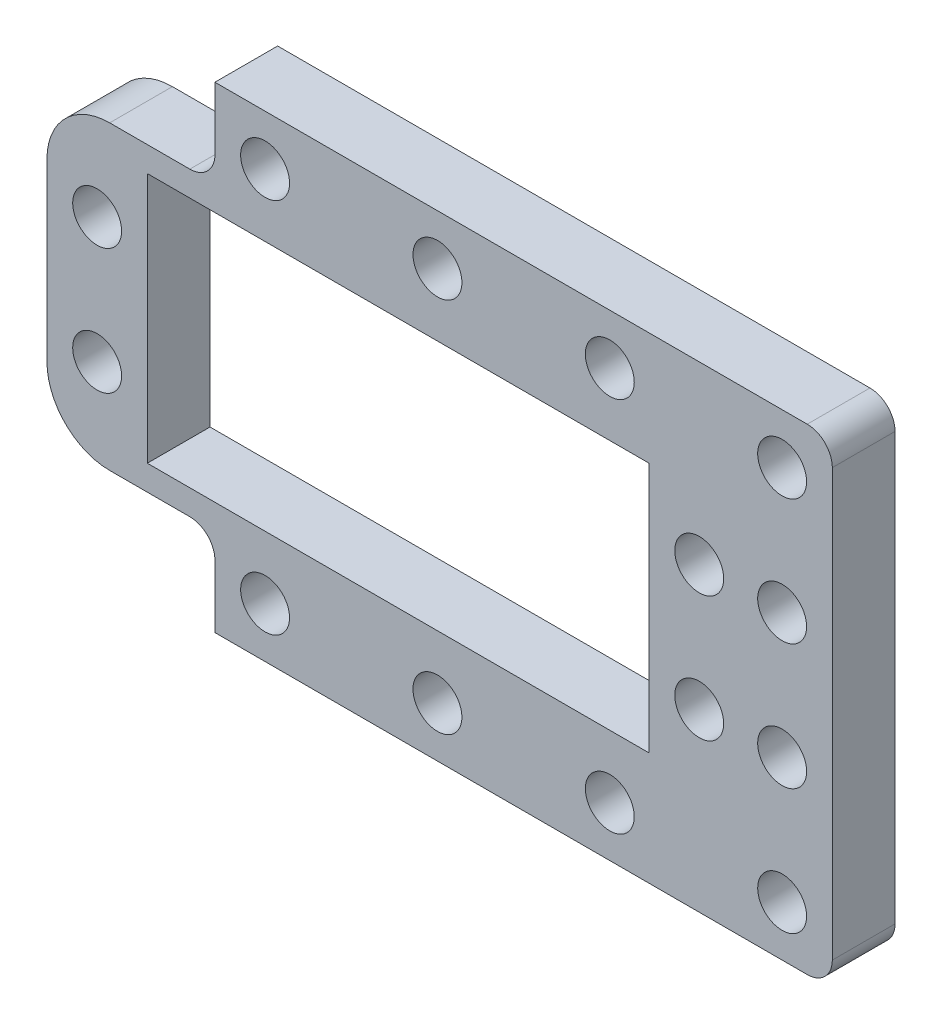
ISO-10303-21;
HEADER;
FILE_DESCRIPTION(('STEP AP214'),'2;1');
FILE_NAME('part.step','',(''),(''),'','','');
FILE_SCHEMA(('AUTOMOTIVE_DESIGN { 1 0 10303 214 1 1 1 1 }'));
ENDSEC;
DATA;
#1=APPLICATION_CONTEXT('core data for automotive mechanical design processes');
#2=APPLICATION_PROTOCOL_DEFINITION('international standard','automotive_design',2000,#1);
#3=PRODUCT_CONTEXT('',#1,'mechanical');
#4=PRODUCT('Part','Part','',(#3));
#5=PRODUCT_RELATED_PRODUCT_CATEGORY('part','',(#4));
#6=PRODUCT_DEFINITION_FORMATION('','',#4);
#7=PRODUCT_DEFINITION_CONTEXT('part definition',#1,'design');
#8=PRODUCT_DEFINITION('design','',#6,#7);
#9=PRODUCT_DEFINITION_SHAPE('','',#8);
#10=(LENGTH_UNIT() NAMED_UNIT(*) SI_UNIT(.MILLI.,.METRE.));
#11=(NAMED_UNIT(*) PLANE_ANGLE_UNIT() SI_UNIT($,.RADIAN.));
#12=(NAMED_UNIT(*) SI_UNIT($,.STERADIAN.) SOLID_ANGLE_UNIT());
#13=UNCERTAINTY_MEASURE_WITH_UNIT(LENGTH_MEASURE(1.E-05),#10,'distance_accuracy_value','');
#14=(GEOMETRIC_REPRESENTATION_CONTEXT(3) GLOBAL_UNCERTAINTY_ASSIGNED_CONTEXT((#13)) GLOBAL_UNIT_ASSIGNED_CONTEXT((#10,
#11,#12)) REPRESENTATION_CONTEXT('',''));
#15=CARTESIAN_POINT('',(0.,0.,0.));
#16=DIRECTION('',(0.,0.,1.));
#17=DIRECTION('',(1.,0.,0.));
#18=AXIS2_PLACEMENT_3D('',#15,#16,#17);
#19=CARTESIAN_POINT('',(-2.,-36.,5.));
#20=DIRECTION('',(0.,0.,1.));
#21=DIRECTION('',(1.,0.,0.));
#22=AXIS2_PLACEMENT_3D('',#19,#20,#21);
#23=PLANE('',#22);
#24=DIRECTION('',(0.,-1.,0.));
#25=VECTOR('',#24,1.);
#26=CARTESIAN_POINT('',(-62.61,-2.00000000000001,5.));
#27=LINE('',#26,#25);
#28=CARTESIAN_POINT('',(-62.61,-12.,5.));
#29=VERTEX_POINT('',#28);
#30=CARTESIAN_POINT('',(-62.61,-26.,5.));
#31=VERTEX_POINT('',#30);
#32=EDGE_CURVE('E253',#29,#31,#27,.T.);
#33=ORIENTED_EDGE('',*,*,#32,.T.);
#34=CARTESIAN_POINT('',(-57.61,-26.,5.));
#35=DIRECTION('',(0.,0.,1.));
#36=DIRECTION('',(1.,0.,0.));
#37=AXIS2_PLACEMENT_3D('',#34,#35,#36);
#38=CIRCLE('',#37,5.);
#39=CARTESIAN_POINT('',(-57.61,-31.,5.));
#40=VERTEX_POINT('',#39);
#41=EDGE_CURVE('E236',#31,#40,#38,.T.);
#42=ORIENTED_EDGE('',*,*,#41,.T.);
#43=DIRECTION('',(-1.,0.,0.));
#44=VECTOR('',#43,1.);
#45=CARTESIAN_POINT('',(-49.22,-31.,5.));
#46=LINE('',#45,#44);
#47=CARTESIAN_POINT('',(-51.22,-31.,5.));
#48=VERTEX_POINT('',#47);
#49=EDGE_CURVE('E252',#48,#40,#46,.T.);
#50=ORIENTED_EDGE('',*,*,#49,.F.);
#51=CARTESIAN_POINT('',(-51.22,-33.,5.));
#52=DIRECTION('',(0.,0.,1.));
#53=DIRECTION('',(1.,0.,0.));
#54=AXIS2_PLACEMENT_3D('',#51,#52,#53);
#55=CIRCLE('',#54,2.);
#56=CARTESIAN_POINT('',(-49.22,-33.,5.));
#57=VERTEX_POINT('',#56);
#58=EDGE_CURVE('E221',#48,#57,#55,.F.);
#59=ORIENTED_EDGE('',*,*,#58,.T.);
#60=DIRECTION('',(0.,1.,0.));
#61=VECTOR('',#60,1.);
#62=CARTESIAN_POINT('',(-49.22,-31.,5.));
#63=LINE('',#62,#61);
#64=CARTESIAN_POINT('',(-49.22,-38.,5.));
#65=VERTEX_POINT('',#64);
#66=EDGE_CURVE('E257',#65,#57,#63,.T.);
#67=ORIENTED_EDGE('',*,*,#66,.F.);
#68=DIRECTION('',(1.,0.,0.));
#69=VECTOR('',#68,1.);
#70=CARTESIAN_POINT('',(-2.,-38.,5.));
#71=LINE('',#70,#69);
#72=CARTESIAN_POINT('',(-2.,-38.,5.));
#73=VERTEX_POINT('',#72);
#74=EDGE_CURVE('E203',#65,#73,#71,.T.);
#75=ORIENTED_EDGE('',*,*,#74,.T.);
#76=CARTESIAN_POINT('',(-2.,-36.,5.));
#77=DIRECTION('',(0.,0.,1.));
#78=DIRECTION('',(1.,0.,0.));
#79=AXIS2_PLACEMENT_3D('',#76,#77,#78);
#80=CIRCLE('',#79,2.);
#81=CARTESIAN_POINT('',(0.,-36.,5.));
#82=VERTEX_POINT('',#81);
#83=EDGE_CURVE('E199',#73,#82,#80,.T.);
#84=ORIENTED_EDGE('',*,*,#83,.T.);
#85=DIRECTION('',(0.,1.,0.));
#86=VECTOR('',#85,1.);
#87=CARTESIAN_POINT('',(0.,-2.,5.));
#88=LINE('',#87,#86);
#89=CARTESIAN_POINT('',(0.,-2.,5.));
#90=VERTEX_POINT('',#89);
#91=EDGE_CURVE('E384',#82,#90,#88,.T.);
#92=ORIENTED_EDGE('',*,*,#91,.T.);
#93=CARTESIAN_POINT('',(-2.,-2.,5.));
#94=DIRECTION('',(0.,0.,1.));
#95=DIRECTION('',(-1.,0.,0.));
#96=AXIS2_PLACEMENT_3D('',#93,#94,#95);
#97=CIRCLE('',#96,2.);
#98=CARTESIAN_POINT('',(-2.,0.,5.));
#99=VERTEX_POINT('',#98);
#100=EDGE_CURVE('E386',#90,#99,#97,.T.);
#101=ORIENTED_EDGE('',*,*,#100,.T.);
#102=DIRECTION('',(-1.,0.,0.));
#103=VECTOR('',#102,1.);
#104=CARTESIAN_POINT('',(-2.,0.,5.));
#105=LINE('',#104,#103);
#106=CARTESIAN_POINT('',(-49.22,0.,5.));
#107=VERTEX_POINT('',#106);
#108=EDGE_CURVE('E388',#99,#107,#105,.T.);
#109=ORIENTED_EDGE('',*,*,#108,.T.);
#110=DIRECTION('',(0.,1.,0.));
#111=VECTOR('',#110,1.);
#112=CARTESIAN_POINT('',(-49.22,0.,5.));
#113=LINE('',#112,#111);
#114=CARTESIAN_POINT('',(-49.22,-5.,5.));
#115=VERTEX_POINT('',#114);
#116=EDGE_CURVE('E178',#115,#107,#113,.T.);
#117=ORIENTED_EDGE('',*,*,#116,.F.);
#118=CARTESIAN_POINT('',(-51.22,-5.,5.));
#119=DIRECTION('',(0.,0.,1.));
#120=DIRECTION('',(1.,0.,0.));
#121=AXIS2_PLACEMENT_3D('',#118,#119,#120);
#122=CIRCLE('',#121,2.);
#123=CARTESIAN_POINT('',(-51.22,-7.,5.));
#124=VERTEX_POINT('',#123);
#125=EDGE_CURVE('E225',#115,#124,#122,.F.);
#126=ORIENTED_EDGE('',*,*,#125,.T.);
#127=DIRECTION('',(1.,0.,0.));
#128=VECTOR('',#127,1.);
#129=CARTESIAN_POINT('',(-49.22,-7.,5.));
#130=LINE('',#129,#128);
#131=CARTESIAN_POINT('',(-57.61,-7.,5.));
#132=VERTEX_POINT('',#131);
#133=EDGE_CURVE('E172',#132,#124,#130,.T.);
#134=ORIENTED_EDGE('',*,*,#133,.F.);
#135=CARTESIAN_POINT('',(-57.61,-12.,5.));
#136=DIRECTION('',(0.,0.,1.));
#137=DIRECTION('',(1.,0.,0.));
#138=AXIS2_PLACEMENT_3D('',#135,#136,#137);
#139=CIRCLE('',#138,5.);
#140=EDGE_CURVE('E234',#132,#29,#139,.T.);
#141=ORIENTED_EDGE('',*,*,#140,.T.);
#142=EDGE_LOOP('',(#33,#42,#50,#59,#67,#75,#84,#92,#101,#109,#117,#126,#134,#141));
#143=FACE_BOUND('',#142,.T.);
#144=CARTESIAN_POINT('',(-17.74,-34.,5.));
#145=DIRECTION('',(0.,0.,1.));
#146=DIRECTION('',(-1.,0.,0.));
#147=AXIS2_PLACEMENT_3D('',#144,#145,#146);
#148=CIRCLE('',#147,1.95);
#149=CARTESIAN_POINT('',(-19.69,-34.,5.));
#150=VERTEX_POINT('',#149);
#151=EDGE_CURVE('E273',#150,#150,#148,.T.);
#152=ORIENTED_EDGE('',*,*,#151,.F.);
#153=EDGE_LOOP('',(#152));
#154=FACE_BOUND('',#153,.T.);
#155=CARTESIAN_POINT('',(-3.99999999999999,-34.,5.));
#156=DIRECTION('',(0.,0.,1.));
#157=DIRECTION('',(-1.,0.,0.));
#158=AXIS2_PLACEMENT_3D('',#155,#156,#157);
#159=CIRCLE('',#158,1.95);
#160=CARTESIAN_POINT('',(-5.94999999999999,-34.,5.));
#161=VERTEX_POINT('',#160);
#162=EDGE_CURVE('E285',#161,#161,#159,.T.);
#163=ORIENTED_EDGE('',*,*,#162,.F.);
#164=EDGE_LOOP('',(#163));
#165=FACE_BOUND('',#164,.T.);
#166=CARTESIAN_POINT('',(-4.,-14.,5.));
#167=DIRECTION('',(0.,0.,1.));
#168=DIRECTION('',(1.,0.,0.));
#169=AXIS2_PLACEMENT_3D('',#166,#167,#168);
#170=CIRCLE('',#169,1.95);
#171=CARTESIAN_POINT('',(-2.05,-14.,5.));
#172=VERTEX_POINT('',#171);
#173=EDGE_CURVE('E297',#172,#172,#170,.T.);
#174=ORIENTED_EDGE('',*,*,#173,.F.);
#175=EDGE_LOOP('',(#174));
#176=FACE_BOUND('',#175,.T.);
#177=CARTESIAN_POINT('',(-45.22,-4.00000000000001,5.));
#178=DIRECTION('',(0.,0.,1.));
#179=DIRECTION('',(1.,0.,0.));
#180=AXIS2_PLACEMENT_3D('',#177,#178,#179);
#181=CIRCLE('',#180,1.95);
#182=CARTESIAN_POINT('',(-43.27,-4.00000000000001,5.));
#183=VERTEX_POINT('',#182);
#184=EDGE_CURVE('E309',#183,#183,#181,.T.);
#185=ORIENTED_EDGE('',*,*,#184,.F.);
#186=EDGE_LOOP('',(#185));
#187=FACE_BOUND('',#186,.T.);
#188=CARTESIAN_POINT('',(-58.61,-24.,5.));
#189=DIRECTION('',(0.,0.,1.));
#190=DIRECTION('',(-1.,0.,0.));
#191=AXIS2_PLACEMENT_3D('',#188,#189,#190);
#192=CIRCLE('',#191,1.95);
#193=CARTESIAN_POINT('',(-60.56,-24.,5.));
#194=VERTEX_POINT('',#193);
#195=EDGE_CURVE('E321',#194,#194,#192,.T.);
#196=ORIENTED_EDGE('',*,*,#195,.F.);
#197=EDGE_LOOP('',(#196));
#198=FACE_BOUND('',#197,.T.);
#199=CARTESIAN_POINT('',(-10.61,-24.,5.));
#200=DIRECTION('',(0.,0.,1.));
#201=DIRECTION('',(1.,0.,0.));
#202=AXIS2_PLACEMENT_3D('',#199,#200,#201);
#203=CIRCLE('',#202,1.95);
#204=CARTESIAN_POINT('',(-8.65999999999999,-24.,5.));
#205=VERTEX_POINT('',#204);
#206=EDGE_CURVE('E333',#205,#205,#203,.T.);
#207=ORIENTED_EDGE('',*,*,#206,.F.);
#208=EDGE_LOOP('',(#207));
#209=FACE_BOUND('',#208,.T.);
#210=DIRECTION('',(1.,0.,0.));
#211=VECTOR('',#210,1.);
#212=CARTESIAN_POINT('',(-54.61,-29.,5.));
#213=LINE('',#212,#211);
#214=CARTESIAN_POINT('',(-54.61,-29.,5.));
#215=VERTEX_POINT('',#214);
#216=CARTESIAN_POINT('',(-14.61,-29.,5.));
#217=VERTEX_POINT('',#216);
#218=EDGE_CURVE('E347',#215,#217,#213,.T.);
#219=ORIENTED_EDGE('',*,*,#218,.F.);
#220=DIRECTION('',(0.,-1.,0.));
#221=VECTOR('',#220,1.);
#222=CARTESIAN_POINT('',(-54.61,-9.,5.));
#223=LINE('',#222,#221);
#224=CARTESIAN_POINT('',(-54.61,-9.,5.));
#225=VERTEX_POINT('',#224);
#226=EDGE_CURVE('E345',#225,#215,#223,.T.);
#227=ORIENTED_EDGE('',*,*,#226,.F.);
#228=DIRECTION('',(-1.,0.,0.));
#229=VECTOR('',#228,1.);
#230=CARTESIAN_POINT('',(-54.61,-9.,5.));
#231=LINE('',#230,#229);
#232=CARTESIAN_POINT('',(-14.61,-9.,5.));
#233=VERTEX_POINT('',#232);
#234=EDGE_CURVE('E353',#233,#225,#231,.T.);
#235=ORIENTED_EDGE('',*,*,#234,.F.);
#236=DIRECTION('',(0.,1.,0.));
#237=VECTOR('',#236,1.);
#238=CARTESIAN_POINT('',(-14.61,-9.,5.));
#239=LINE('',#238,#237);
#240=EDGE_CURVE('E350',#217,#233,#239,.T.);
#241=ORIENTED_EDGE('',*,*,#240,.F.);
#242=EDGE_LOOP('',(#219,#227,#235,#241));
#243=FACE_BOUND('',#242,.T.);
#244=CARTESIAN_POINT('',(-4.,-24.,5.));
#245=DIRECTION('',(0.,0.,1.));
#246=DIRECTION('',(1.,0.,0.));
#247=AXIS2_PLACEMENT_3D('',#244,#245,#246);
#248=CIRCLE('',#247,1.95);
#249=CARTESIAN_POINT('',(-2.05,-24.,5.));
#250=VERTEX_POINT('',#249);
#251=EDGE_CURVE('E376',#250,#250,#248,.T.);
#252=ORIENTED_EDGE('',*,*,#251,.F.);
#253=EDGE_LOOP('',(#252));
#254=FACE_BOUND('',#253,.T.);
#255=CARTESIAN_POINT('',(-45.22,-34.,5.));
#256=DIRECTION('',(0.,0.,1.));
#257=DIRECTION('',(-1.,0.,0.));
#258=AXIS2_PLACEMENT_3D('',#255,#256,#257);
#259=CIRCLE('',#258,1.95);
#260=CARTESIAN_POINT('',(-47.17,-34.,5.));
#261=VERTEX_POINT('',#260);
#262=EDGE_CURVE('E339',#261,#261,#259,.T.);
#263=ORIENTED_EDGE('',*,*,#262,.F.);
#264=EDGE_LOOP('',(#263));
#265=FACE_BOUND('',#264,.T.);
#266=CARTESIAN_POINT('',(-10.61,-14.,5.));
#267=DIRECTION('',(0.,0.,1.));
#268=DIRECTION('',(1.,0.,0.));
#269=AXIS2_PLACEMENT_3D('',#266,#267,#268);
#270=CIRCLE('',#269,1.95);
#271=CARTESIAN_POINT('',(-8.65999999999999,-14.,5.));
#272=VERTEX_POINT('',#271);
#273=EDGE_CURVE('E327',#272,#272,#270,.T.);
#274=ORIENTED_EDGE('',*,*,#273,.F.);
#275=EDGE_LOOP('',(#274));
#276=FACE_BOUND('',#275,.T.);
#277=CARTESIAN_POINT('',(-58.61,-14.,5.));
#278=DIRECTION('',(0.,0.,1.));
#279=DIRECTION('',(-1.,0.,0.));
#280=AXIS2_PLACEMENT_3D('',#277,#278,#279);
#281=CIRCLE('',#280,1.95);
#282=CARTESIAN_POINT('',(-60.56,-14.,5.));
#283=VERTEX_POINT('',#282);
#284=EDGE_CURVE('E315',#283,#283,#281,.T.);
#285=ORIENTED_EDGE('',*,*,#284,.F.);
#286=EDGE_LOOP('',(#285));
#287=FACE_BOUND('',#286,.T.);
#288=CARTESIAN_POINT('',(-4.,-4.00000000000001,5.));
#289=DIRECTION('',(0.,0.,1.));
#290=DIRECTION('',(1.,0.,0.));
#291=AXIS2_PLACEMENT_3D('',#288,#289,#290);
#292=CIRCLE('',#291,1.95);
#293=CARTESIAN_POINT('',(-2.05,-4.00000000000001,5.));
#294=VERTEX_POINT('',#293);
#295=EDGE_CURVE('E303',#294,#294,#292,.T.);
#296=ORIENTED_EDGE('',*,*,#295,.F.);
#297=EDGE_LOOP('',(#296));
#298=FACE_BOUND('',#297,.T.);
#299=CARTESIAN_POINT('',(-31.48,-4.00000000000001,5.));
#300=DIRECTION('',(0.,0.,1.));
#301=DIRECTION('',(1.,0.,0.));
#302=AXIS2_PLACEMENT_3D('',#299,#300,#301);
#303=CIRCLE('',#302,1.95);
#304=CARTESIAN_POINT('',(-29.53,-4.00000000000001,5.));
#305=VERTEX_POINT('',#304);
#306=EDGE_CURVE('E291',#305,#305,#303,.T.);
#307=ORIENTED_EDGE('',*,*,#306,.F.);
#308=EDGE_LOOP('',(#307));
#309=FACE_BOUND('',#308,.T.);
#310=CARTESIAN_POINT('',(-17.74,-4.00000000000001,5.));
#311=DIRECTION('',(0.,0.,1.));
#312=DIRECTION('',(1.,0.,0.));
#313=AXIS2_PLACEMENT_3D('',#310,#311,#312);
#314=CIRCLE('',#313,1.95);
#315=CARTESIAN_POINT('',(-15.79,-4.00000000000001,5.));
#316=VERTEX_POINT('',#315);
#317=EDGE_CURVE('E279',#316,#316,#314,.T.);
#318=ORIENTED_EDGE('',*,*,#317,.F.);
#319=EDGE_LOOP('',(#318));
#320=FACE_BOUND('',#319,.T.);
#321=CARTESIAN_POINT('',(-31.48,-34.,5.));
#322=DIRECTION('',(0.,0.,1.));
#323=DIRECTION('',(-1.,0.,0.));
#324=AXIS2_PLACEMENT_3D('',#321,#322,#323);
#325=CIRCLE('',#324,1.95);
#326=CARTESIAN_POINT('',(-33.43,-34.,5.));
#327=VERTEX_POINT('',#326);
#328=EDGE_CURVE('E267',#327,#327,#325,.T.);
#329=ORIENTED_EDGE('',*,*,#328,.F.);
#330=EDGE_LOOP('',(#329));
#331=FACE_BOUND('',#330,.T.);
#332=ADVANCED_FACE('F32',(#143,#154,#165,#176,#187,#198,#209,#243,#254,#265,#276,#287,#298,#309,
#320,#331),#23,.T.);
#333=CARTESIAN_POINT('',(-2.,-36.,0.));
#334=DIRECTION('',(0.,0.,1.));
#335=DIRECTION('',(1.,0.,0.));
#336=AXIS2_PLACEMENT_3D('',#333,#334,#335);
#337=PLANE('',#336);
#338=CARTESIAN_POINT('',(-4.,-24.,0.));
#339=DIRECTION('',(0.,0.,1.));
#340=DIRECTION('',(1.,0.,0.));
#341=AXIS2_PLACEMENT_3D('',#338,#339,#340);
#342=CIRCLE('',#341,1.95);
#343=CARTESIAN_POINT('',(-2.05,-24.,0.));
#344=VERTEX_POINT('',#343);
#345=EDGE_CURVE('E375',#344,#344,#342,.T.);
#346=ORIENTED_EDGE('',*,*,#345,.T.);
#347=EDGE_LOOP('',(#346));
#348=FACE_BOUND('',#347,.T.);
#349=DIRECTION('',(-1.,0.,0.));
#350=VECTOR('',#349,1.);
#351=CARTESIAN_POINT('',(-49.22,-31.,0.));
#352=LINE('',#351,#350);
#353=CARTESIAN_POINT('',(-51.22,-31.,0.));
#354=VERTEX_POINT('',#353);
#355=CARTESIAN_POINT('',(-57.61,-31.,0.));
#356=VERTEX_POINT('',#355);
#357=EDGE_CURVE('E240',#354,#356,#352,.T.);
#358=ORIENTED_EDGE('',*,*,#357,.T.);
#359=CARTESIAN_POINT('',(-57.61,-26.,0.));
#360=DIRECTION('',(0.,0.,1.));
#361=DIRECTION('',(1.,0.,0.));
#362=AXIS2_PLACEMENT_3D('',#359,#360,#361);
#363=CIRCLE('',#362,5.);
#364=CARTESIAN_POINT('',(-62.61,-26.,0.));
#365=VERTEX_POINT('',#364);
#366=EDGE_CURVE('E40',#356,#365,#363,.F.);
#367=ORIENTED_EDGE('',*,*,#366,.T.);
#368=DIRECTION('',(0.,-1.,0.));
#369=VECTOR('',#368,1.);
#370=CARTESIAN_POINT('',(-62.61,-2.00000000000001,0.));
#371=LINE('',#370,#369);
#372=CARTESIAN_POINT('',(-62.61,-12.,0.));
#373=VERTEX_POINT('',#372);
#374=EDGE_CURVE('E188',#373,#365,#371,.T.);
#375=ORIENTED_EDGE('',*,*,#374,.F.);
#376=CARTESIAN_POINT('',(-57.61,-12.,0.));
#377=DIRECTION('',(0.,0.,1.));
#378=DIRECTION('',(1.,0.,0.));
#379=AXIS2_PLACEMENT_3D('',#376,#377,#378);
#380=CIRCLE('',#379,5.);
#381=CARTESIAN_POINT('',(-57.61,-7.,0.));
#382=VERTEX_POINT('',#381);
#383=EDGE_CURVE('E47',#373,#382,#380,.F.);
#384=ORIENTED_EDGE('',*,*,#383,.T.);
#385=DIRECTION('',(1.,0.,0.));
#386=VECTOR('',#385,1.);
#387=CARTESIAN_POINT('',(-49.22,-7.,0.));
#388=LINE('',#387,#386);
#389=CARTESIAN_POINT('',(-51.22,-7.,0.));
#390=VERTEX_POINT('',#389);
#391=EDGE_CURVE('E171',#382,#390,#388,.T.);
#392=ORIENTED_EDGE('',*,*,#391,.T.);
#393=CARTESIAN_POINT('',(-51.22,-5.,0.));
#394=DIRECTION('',(0.,0.,1.));
#395=DIRECTION('',(1.,0.,0.));
#396=AXIS2_PLACEMENT_3D('',#393,#394,#395);
#397=CIRCLE('',#396,2.);
#398=CARTESIAN_POINT('',(-49.22,-5.,0.));
#399=VERTEX_POINT('',#398);
#400=EDGE_CURVE('E167',#390,#399,#397,.T.);
#401=ORIENTED_EDGE('',*,*,#400,.T.);
#402=DIRECTION('',(0.,1.,0.));
#403=VECTOR('',#402,1.);
#404=CARTESIAN_POINT('',(-49.22,0.,0.));
#405=LINE('',#404,#403);
#406=CARTESIAN_POINT('',(-49.22,0.,0.));
#407=VERTEX_POINT('',#406);
#408=EDGE_CURVE('E159',#399,#407,#405,.T.);
#409=ORIENTED_EDGE('',*,*,#408,.T.);
#410=DIRECTION('',(-1.,0.,0.));
#411=VECTOR('',#410,1.);
#412=CARTESIAN_POINT('',(-2.,0.,0.));
#413=LINE('',#412,#411);
#414=CARTESIAN_POINT('',(-2.,0.,0.));
#415=VERTEX_POINT('',#414);
#416=EDGE_CURVE('E165',#415,#407,#413,.T.);
#417=ORIENTED_EDGE('',*,*,#416,.F.);
#418=CARTESIAN_POINT('',(-2.,-2.,0.));
#419=DIRECTION('',(0.,0.,1.));
#420=DIRECTION('',(-1.,0.,0.));
#421=AXIS2_PLACEMENT_3D('',#418,#419,#420);
#422=CIRCLE('',#421,2.);
#423=CARTESIAN_POINT('',(0.,-2.,0.));
#424=VERTEX_POINT('',#423);
#425=EDGE_CURVE('E189',#424,#415,#422,.T.);
#426=ORIENTED_EDGE('',*,*,#425,.F.);
#427=DIRECTION('',(0.,1.,0.));
#428=VECTOR('',#427,1.);
#429=CARTESIAN_POINT('',(0.,-2.,0.));
#430=LINE('',#429,#428);
#431=CARTESIAN_POINT('',(0.,-36.,0.));
#432=VERTEX_POINT('',#431);
#433=EDGE_CURVE('E194',#432,#424,#430,.T.);
#434=ORIENTED_EDGE('',*,*,#433,.F.);
#435=CARTESIAN_POINT('',(-2.,-36.,0.));
#436=DIRECTION('',(0.,0.,1.));
#437=DIRECTION('',(1.,0.,0.));
#438=AXIS2_PLACEMENT_3D('',#435,#436,#437);
#439=CIRCLE('',#438,2.);
#440=CARTESIAN_POINT('',(-2.,-38.,0.));
#441=VERTEX_POINT('',#440);
#442=EDGE_CURVE('E379',#441,#432,#439,.T.);
#443=ORIENTED_EDGE('',*,*,#442,.F.);
#444=DIRECTION('',(1.,0.,0.));
#445=VECTOR('',#444,1.);
#446=CARTESIAN_POINT('',(-2.,-38.,0.));
#447=LINE('',#446,#445);
#448=CARTESIAN_POINT('',(-49.22,-38.,0.));
#449=VERTEX_POINT('',#448);
#450=EDGE_CURVE('E192',#449,#441,#447,.T.);
#451=ORIENTED_EDGE('',*,*,#450,.F.);
#452=DIRECTION('',(0.,1.,0.));
#453=VECTOR('',#452,1.);
#454=CARTESIAN_POINT('',(-49.22,-31.,0.));
#455=LINE('',#454,#453);
#456=CARTESIAN_POINT('',(-49.22,-33.,0.));
#457=VERTEX_POINT('',#456);
#458=EDGE_CURVE('E256',#449,#457,#455,.T.);
#459=ORIENTED_EDGE('',*,*,#458,.T.);
#460=CARTESIAN_POINT('',(-51.22,-33.,0.));
#461=DIRECTION('',(0.,0.,1.));
#462=DIRECTION('',(1.,0.,0.));
#463=AXIS2_PLACEMENT_3D('',#460,#461,#462);
#464=CIRCLE('',#463,2.);
#465=EDGE_CURVE('E223',#457,#354,#464,.T.);
#466=ORIENTED_EDGE('',*,*,#465,.T.);
#467=EDGE_LOOP('',(#358,#367,#375,#384,#392,#401,#409,#417,#426,#434,#443,#451,#459,#466));
#468=FACE_BOUND('',#467,.T.);
#469=DIRECTION('',(0.,-1.,0.));
#470=VECTOR('',#469,1.);
#471=CARTESIAN_POINT('',(-54.61,-9.,0.));
#472=LINE('',#471,#470);
#473=CARTESIAN_POINT('',(-54.61,-9.,0.));
#474=VERTEX_POINT('',#473);
#475=CARTESIAN_POINT('',(-54.61,-29.,0.));
#476=VERTEX_POINT('',#475);
#477=EDGE_CURVE('E342',#474,#476,#472,.T.);
#478=ORIENTED_EDGE('',*,*,#477,.T.);
#479=DIRECTION('',(1.,0.,0.));
#480=VECTOR('',#479,1.);
#481=CARTESIAN_POINT('',(-54.61,-29.,0.));
#482=LINE('',#481,#480);
#483=CARTESIAN_POINT('',(-14.61,-29.,0.));
#484=VERTEX_POINT('',#483);
#485=EDGE_CURVE('E358',#476,#484,#482,.T.);
#486=ORIENTED_EDGE('',*,*,#485,.T.);
#487=DIRECTION('',(0.,1.,0.));
#488=VECTOR('',#487,1.);
#489=CARTESIAN_POINT('',(-14.61,-9.,0.));
#490=LINE('',#489,#488);
#491=CARTESIAN_POINT('',(-14.61,-9.,0.));
#492=VERTEX_POINT('',#491);
#493=EDGE_CURVE('E361',#484,#492,#490,.T.);
#494=ORIENTED_EDGE('',*,*,#493,.T.);
#495=DIRECTION('',(-1.,0.,0.));
#496=VECTOR('',#495,1.);
#497=CARTESIAN_POINT('',(-54.61,-9.,0.));
#498=LINE('',#497,#496);
#499=EDGE_CURVE('E348',#492,#474,#498,.T.);
#500=ORIENTED_EDGE('',*,*,#499,.T.);
#501=EDGE_LOOP('',(#478,#486,#494,#500));
#502=FACE_BOUND('',#501,.T.);
#503=CARTESIAN_POINT('',(-45.22,-34.,0.));
#504=DIRECTION('',(0.,0.,1.));
#505=DIRECTION('',(-1.,0.,0.));
#506=AXIS2_PLACEMENT_3D('',#503,#504,#505);
#507=CIRCLE('',#506,1.95);
#508=CARTESIAN_POINT('',(-47.17,-34.,0.));
#509=VERTEX_POINT('',#508);
#510=EDGE_CURVE('E336',#509,#509,#507,.T.);
#511=ORIENTED_EDGE('',*,*,#510,.T.);
#512=EDGE_LOOP('',(#511));
#513=FACE_BOUND('',#512,.T.);
#514=CARTESIAN_POINT('',(-10.61,-24.,0.));
#515=DIRECTION('',(0.,0.,1.));
#516=DIRECTION('',(1.,0.,0.));
#517=AXIS2_PLACEMENT_3D('',#514,#515,#516);
#518=CIRCLE('',#517,1.95);
#519=CARTESIAN_POINT('',(-8.65999999999999,-24.,0.));
#520=VERTEX_POINT('',#519);
#521=EDGE_CURVE('E330',#520,#520,#518,.T.);
#522=ORIENTED_EDGE('',*,*,#521,.T.);
#523=EDGE_LOOP('',(#522));
#524=FACE_BOUND('',#523,.T.);
#525=CARTESIAN_POINT('',(-10.61,-14.,0.));
#526=DIRECTION('',(0.,0.,1.));
#527=DIRECTION('',(1.,0.,0.));
#528=AXIS2_PLACEMENT_3D('',#525,#526,#527);
#529=CIRCLE('',#528,1.95);
#530=CARTESIAN_POINT('',(-8.65999999999999,-14.,0.));
#531=VERTEX_POINT('',#530);
#532=EDGE_CURVE('E324',#531,#531,#529,.T.);
#533=ORIENTED_EDGE('',*,*,#532,.T.);
#534=EDGE_LOOP('',(#533));
#535=FACE_BOUND('',#534,.T.);
#536=CARTESIAN_POINT('',(-58.61,-24.,0.));
#537=DIRECTION('',(0.,0.,1.));
#538=DIRECTION('',(-1.,0.,0.));
#539=AXIS2_PLACEMENT_3D('',#536,#537,#538);
#540=CIRCLE('',#539,1.95);
#541=CARTESIAN_POINT('',(-60.56,-24.,0.));
#542=VERTEX_POINT('',#541);
#543=EDGE_CURVE('E318',#542,#542,#540,.T.);
#544=ORIENTED_EDGE('',*,*,#543,.T.);
#545=EDGE_LOOP('',(#544));
#546=FACE_BOUND('',#545,.T.);
#547=CARTESIAN_POINT('',(-58.61,-14.,0.));
#548=DIRECTION('',(0.,0.,1.));
#549=DIRECTION('',(-1.,0.,0.));
#550=AXIS2_PLACEMENT_3D('',#547,#548,#549);
#551=CIRCLE('',#550,1.95);
#552=CARTESIAN_POINT('',(-60.56,-14.,0.));
#553=VERTEX_POINT('',#552);
#554=EDGE_CURVE('E312',#553,#553,#551,.T.);
#555=ORIENTED_EDGE('',*,*,#554,.T.);
#556=EDGE_LOOP('',(#555));
#557=FACE_BOUND('',#556,.T.);
#558=CARTESIAN_POINT('',(-45.22,-4.00000000000001,0.));
#559=DIRECTION('',(0.,0.,1.));
#560=DIRECTION('',(1.,0.,0.));
#561=AXIS2_PLACEMENT_3D('',#558,#559,#560);
#562=CIRCLE('',#561,1.95);
#563=CARTESIAN_POINT('',(-43.27,-4.00000000000001,0.));
#564=VERTEX_POINT('',#563);
#565=EDGE_CURVE('E306',#564,#564,#562,.T.);
#566=ORIENTED_EDGE('',*,*,#565,.T.);
#567=EDGE_LOOP('',(#566));
#568=FACE_BOUND('',#567,.T.);
#569=CARTESIAN_POINT('',(-4.,-4.00000000000001,0.));
#570=DIRECTION('',(0.,0.,1.));
#571=DIRECTION('',(1.,0.,0.));
#572=AXIS2_PLACEMENT_3D('',#569,#570,#571);
#573=CIRCLE('',#572,1.95);
#574=CARTESIAN_POINT('',(-2.05,-4.00000000000001,0.));
#575=VERTEX_POINT('',#574);
#576=EDGE_CURVE('E300',#575,#575,#573,.T.);
#577=ORIENTED_EDGE('',*,*,#576,.T.);
#578=EDGE_LOOP('',(#577));
#579=FACE_BOUND('',#578,.T.);
#580=CARTESIAN_POINT('',(-4.,-14.,0.));
#581=DIRECTION('',(0.,0.,1.));
#582=DIRECTION('',(1.,0.,0.));
#583=AXIS2_PLACEMENT_3D('',#580,#581,#582);
#584=CIRCLE('',#583,1.95);
#585=CARTESIAN_POINT('',(-2.05,-14.,0.));
#586=VERTEX_POINT('',#585);
#587=EDGE_CURVE('E294',#586,#586,#584,.T.);
#588=ORIENTED_EDGE('',*,*,#587,.T.);
#589=EDGE_LOOP('',(#588));
#590=FACE_BOUND('',#589,.T.);
#591=CARTESIAN_POINT('',(-31.48,-4.00000000000001,0.));
#592=DIRECTION('',(0.,0.,1.));
#593=DIRECTION('',(1.,0.,0.));
#594=AXIS2_PLACEMENT_3D('',#591,#592,#593);
#595=CIRCLE('',#594,1.95);
#596=CARTESIAN_POINT('',(-29.53,-4.00000000000001,0.));
#597=VERTEX_POINT('',#596);
#598=EDGE_CURVE('E288',#597,#597,#595,.T.);
#599=ORIENTED_EDGE('',*,*,#598,.T.);
#600=EDGE_LOOP('',(#599));
#601=FACE_BOUND('',#600,.T.);
#602=CARTESIAN_POINT('',(-3.99999999999999,-34.,0.));
#603=DIRECTION('',(0.,0.,1.));
#604=DIRECTION('',(-1.,0.,0.));
#605=AXIS2_PLACEMENT_3D('',#602,#603,#604);
#606=CIRCLE('',#605,1.95);
#607=CARTESIAN_POINT('',(-5.94999999999999,-34.,0.));
#608=VERTEX_POINT('',#607);
#609=EDGE_CURVE('E282',#608,#608,#606,.T.);
#610=ORIENTED_EDGE('',*,*,#609,.T.);
#611=EDGE_LOOP('',(#610));
#612=FACE_BOUND('',#611,.T.);
#613=CARTESIAN_POINT('',(-17.74,-4.00000000000001,0.));
#614=DIRECTION('',(0.,0.,1.));
#615=DIRECTION('',(1.,0.,0.));
#616=AXIS2_PLACEMENT_3D('',#613,#614,#615);
#617=CIRCLE('',#616,1.95);
#618=CARTESIAN_POINT('',(-15.79,-4.00000000000001,0.));
#619=VERTEX_POINT('',#618);
#620=EDGE_CURVE('E276',#619,#619,#617,.T.);
#621=ORIENTED_EDGE('',*,*,#620,.T.);
#622=EDGE_LOOP('',(#621));
#623=FACE_BOUND('',#622,.T.);
#624=CARTESIAN_POINT('',(-17.74,-34.,0.));
#625=DIRECTION('',(0.,0.,1.));
#626=DIRECTION('',(-1.,0.,0.));
#627=AXIS2_PLACEMENT_3D('',#624,#625,#626);
#628=CIRCLE('',#627,1.95);
#629=CARTESIAN_POINT('',(-19.69,-34.,0.));
#630=VERTEX_POINT('',#629);
#631=EDGE_CURVE('E270',#630,#630,#628,.T.);
#632=ORIENTED_EDGE('',*,*,#631,.T.);
#633=EDGE_LOOP('',(#632));
#634=FACE_BOUND('',#633,.T.);
#635=CARTESIAN_POINT('',(-31.48,-34.,0.));
#636=DIRECTION('',(0.,0.,1.));
#637=DIRECTION('',(-1.,0.,0.));
#638=AXIS2_PLACEMENT_3D('',#635,#636,#637);
#639=CIRCLE('',#638,1.95);
#640=CARTESIAN_POINT('',(-33.43,-34.,0.));
#641=VERTEX_POINT('',#640);
#642=EDGE_CURVE('E182',#641,#641,#639,.T.);
#643=ORIENTED_EDGE('',*,*,#642,.T.);
#644=EDGE_LOOP('',(#643));
#645=FACE_BOUND('',#644,.T.);
#646=ADVANCED_FACE('F161',(#348,#468,#502,#513,#524,#535,#546,#557,#568,#579,#590,#601,#612,
#623,#634,#645),#337,.F.);
#647=CARTESIAN_POINT('',(-2.,-36.,5.));
#648=DIRECTION('',(0.,0.,-1.));
#649=DIRECTION('',(-1.,0.,0.));
#650=AXIS2_PLACEMENT_3D('',#647,#648,#649);
#651=CYLINDRICAL_SURFACE('',#650,2.);
#652=ORIENTED_EDGE('',*,*,#442,.T.);
#653=DIRECTION('',(0.,0.,-1.));
#654=VECTOR('',#653,1.);
#655=CARTESIAN_POINT('',(0.,-36.,5.));
#656=LINE('',#655,#654);
#657=EDGE_CURVE('E208',#82,#432,#656,.T.);
#658=ORIENTED_EDGE('',*,*,#657,.F.);
#659=ORIENTED_EDGE('',*,*,#83,.F.);
#660=DIRECTION('',(0.,0.,-1.));
#661=VECTOR('',#660,1.);
#662=CARTESIAN_POINT('',(-2.,-38.,5.));
#663=LINE('',#662,#661);
#664=EDGE_CURVE('E200',#73,#441,#663,.T.);
#665=ORIENTED_EDGE('',*,*,#664,.T.);
#666=EDGE_LOOP('',(#652,#658,#659,#665));
#667=FACE_BOUND('',#666,.T.);
#668=ADVANCED_FACE('F406',(#667),#651,.T.);
#669=CARTESIAN_POINT('',(0.,-2.,5.));
#670=DIRECTION('',(-1.,0.,0.));
#671=DIRECTION('',(0.,-1.,0.));
#672=AXIS2_PLACEMENT_3D('',#669,#670,#671);
#673=PLANE('',#672);
#674=ORIENTED_EDGE('',*,*,#433,.T.);
#675=DIRECTION('',(0.,0.,-1.));
#676=VECTOR('',#675,1.);
#677=CARTESIAN_POINT('',(0.,-2.,5.));
#678=LINE('',#677,#676);
#679=EDGE_CURVE('E205',#90,#424,#678,.T.);
#680=ORIENTED_EDGE('',*,*,#679,.F.);
#681=ORIENTED_EDGE('',*,*,#91,.F.);
#682=ORIENTED_EDGE('',*,*,#657,.T.);
#683=EDGE_LOOP('',(#674,#680,#681,#682));
#684=FACE_BOUND('',#683,.T.);
#685=ADVANCED_FACE('F395',(#684),#673,.F.);
#686=CARTESIAN_POINT('',(-2.,-2.,5.));
#687=DIRECTION('',(0.,0.,-1.));
#688=DIRECTION('',(-1.,0.,0.));
#689=AXIS2_PLACEMENT_3D('',#686,#687,#688);
#690=CYLINDRICAL_SURFACE('',#689,2.);
#691=ORIENTED_EDGE('',*,*,#425,.T.);
#692=DIRECTION('',(0.,0.,-1.));
#693=VECTOR('',#692,1.);
#694=CARTESIAN_POINT('',(-2.,0.,5.));
#695=LINE('',#694,#693);
#696=EDGE_CURVE('E187',#99,#415,#695,.T.);
#697=ORIENTED_EDGE('',*,*,#696,.F.);
#698=ORIENTED_EDGE('',*,*,#100,.F.);
#699=ORIENTED_EDGE('',*,*,#679,.T.);
#700=EDGE_LOOP('',(#691,#697,#698,#699));
#701=FACE_BOUND('',#700,.T.);
#702=ADVANCED_FACE('F400',(#701),#690,.T.);
#703=CARTESIAN_POINT('',(-2.,0.,5.));
#704=DIRECTION('',(0.,-1.,0.));
#705=DIRECTION('',(1.,0.,0.));
#706=AXIS2_PLACEMENT_3D('',#703,#704,#705);
#707=PLANE('',#706);
#708=ORIENTED_EDGE('',*,*,#416,.T.);
#709=DIRECTION('',(0.,0.,1.));
#710=VECTOR('',#709,1.);
#711=CARTESIAN_POINT('',(-49.22,0.,0.));
#712=LINE('',#711,#710);
#713=EDGE_CURVE('E175',#407,#107,#712,.T.);
#714=ORIENTED_EDGE('',*,*,#713,.T.);
#715=ORIENTED_EDGE('',*,*,#108,.F.);
#716=ORIENTED_EDGE('',*,*,#696,.T.);
#717=EDGE_LOOP('',(#708,#714,#715,#716));
#718=FACE_BOUND('',#717,.T.);
#719=ADVANCED_FACE('F185',(#718),#707,.F.);
#720=CARTESIAN_POINT('',(-62.61,-2.00000000000001,5.));
#721=DIRECTION('',(1.,0.,0.));
#722=DIRECTION('',(0.,1.,0.));
#723=AXIS2_PLACEMENT_3D('',#720,#721,#722);
#724=PLANE('',#723);
#725=ORIENTED_EDGE('',*,*,#374,.T.);
#726=DIRECTION('',(0.,0.,1.));
#727=VECTOR('',#726,1.);
#728=CARTESIAN_POINT('',(-62.61,-26.,5.));
#729=LINE('',#728,#727);
#730=EDGE_CURVE('E231',#365,#31,#729,.T.);
#731=ORIENTED_EDGE('',*,*,#730,.T.);
#732=ORIENTED_EDGE('',*,*,#32,.F.);
#733=DIRECTION('',(0.,0.,1.));
#734=VECTOR('',#733,1.);
#735=CARTESIAN_POINT('',(-62.61,-12.,5.));
#736=LINE('',#735,#734);
#737=EDGE_CURVE('E229',#29,#373,#736,.F.);
#738=ORIENTED_EDGE('',*,*,#737,.T.);
#739=EDGE_LOOP('',(#725,#731,#732,#738));
#740=FACE_BOUND('',#739,.T.);
#741=ADVANCED_FACE('F244',(#740),#724,.F.);
#742=CARTESIAN_POINT('',(-2.,-38.,5.));
#743=DIRECTION('',(0.,1.,0.));
#744=DIRECTION('',(-1.,0.,0.));
#745=AXIS2_PLACEMENT_3D('',#742,#743,#744);
#746=PLANE('',#745);
#747=ORIENTED_EDGE('',*,*,#74,.F.);
#748=DIRECTION('',(0.,0.,1.));
#749=VECTOR('',#748,1.);
#750=CARTESIAN_POINT('',(-49.22,-38.,0.));
#751=LINE('',#750,#749);
#752=EDGE_CURVE('E265',#449,#65,#751,.T.);
#753=ORIENTED_EDGE('',*,*,#752,.F.);
#754=ORIENTED_EDGE('',*,*,#450,.T.);
#755=ORIENTED_EDGE('',*,*,#664,.F.);
#756=EDGE_LOOP('',(#747,#753,#754,#755));
#757=FACE_BOUND('',#756,.T.);
#758=ADVANCED_FACE('F411',(#757),#746,.F.);
#759=CARTESIAN_POINT('',(-4.,-24.,5.));
#760=DIRECTION('',(0.,0.,-1.));
#761=DIRECTION('',(-1.,0.,0.));
#762=AXIS2_PLACEMENT_3D('',#759,#760,#761);
#763=CYLINDRICAL_SURFACE('',#762,1.95);
#764=ORIENTED_EDGE('',*,*,#251,.T.);
#765=EDGE_LOOP('',(#764));
#766=FACE_BOUND('',#765,.T.);
#767=ORIENTED_EDGE('',*,*,#345,.F.);
#768=EDGE_LOOP('',(#767));
#769=FACE_BOUND('',#768,.T.);
#770=ADVANCED_FACE('F440',(#766,#769),#763,.F.);
#771=CARTESIAN_POINT('',(-54.61,-9.,5.));
#772=DIRECTION('',(1.,0.,0.));
#773=DIRECTION('',(0.,0.,-1.));
#774=AXIS2_PLACEMENT_3D('',#771,#772,#773);
#775=PLANE('',#774);
#776=ORIENTED_EDGE('',*,*,#477,.F.);
#777=DIRECTION('',(0.,0.,-1.));
#778=VECTOR('',#777,1.);
#779=CARTESIAN_POINT('',(-54.61,-9.,5.));
#780=LINE('',#779,#778);
#781=EDGE_CURVE('E355',#225,#474,#780,.T.);
#782=ORIENTED_EDGE('',*,*,#781,.F.);
#783=ORIENTED_EDGE('',*,*,#226,.T.);
#784=DIRECTION('',(0.,0.,-1.));
#785=VECTOR('',#784,1.);
#786=CARTESIAN_POINT('',(-54.61,-29.,5.));
#787=LINE('',#786,#785);
#788=EDGE_CURVE('E372',#215,#476,#787,.T.);
#789=ORIENTED_EDGE('',*,*,#788,.T.);
#790=EDGE_LOOP('',(#776,#782,#783,#789));
#791=FACE_BOUND('',#790,.T.);
#792=ADVANCED_FACE('F622',(#791),#775,.T.);
#793=CARTESIAN_POINT('',(-54.61,-29.,5.));
#794=DIRECTION('',(0.,1.,0.));
#795=DIRECTION('',(-1.,0.,0.));
#796=AXIS2_PLACEMENT_3D('',#793,#794,#795);
#797=PLANE('',#796);
#798=ORIENTED_EDGE('',*,*,#485,.F.);
#799=ORIENTED_EDGE('',*,*,#788,.F.);
#800=ORIENTED_EDGE('',*,*,#218,.T.);
#801=DIRECTION('',(0.,0.,-1.));
#802=VECTOR('',#801,1.);
#803=CARTESIAN_POINT('',(-14.61,-29.,5.));
#804=LINE('',#803,#802);
#805=EDGE_CURVE('E370',#217,#484,#804,.T.);
#806=ORIENTED_EDGE('',*,*,#805,.T.);
#807=EDGE_LOOP('',(#798,#799,#800,#806));
#808=FACE_BOUND('',#807,.T.);
#809=ADVANCED_FACE('F619',(#808),#797,.T.);
#810=CARTESIAN_POINT('',(-14.61,-9.,5.));
#811=DIRECTION('',(-1.,0.,0.));
#812=DIRECTION('',(0.,-1.,0.));
#813=AXIS2_PLACEMENT_3D('',#810,#811,#812);
#814=PLANE('',#813);
#815=ORIENTED_EDGE('',*,*,#493,.F.);
#816=ORIENTED_EDGE('',*,*,#805,.F.);
#817=ORIENTED_EDGE('',*,*,#240,.T.);
#818=DIRECTION('',(0.,0.,-1.));
#819=VECTOR('',#818,1.);
#820=CARTESIAN_POINT('',(-14.61,-9.,5.));
#821=LINE('',#820,#819);
#822=EDGE_CURVE('E368',#233,#492,#821,.T.);
#823=ORIENTED_EDGE('',*,*,#822,.T.);
#824=EDGE_LOOP('',(#815,#816,#817,#823));
#825=FACE_BOUND('',#824,.T.);
#826=ADVANCED_FACE('F615',(#825),#814,.T.);
#827=CARTESIAN_POINT('',(-54.61,-9.,5.));
#828=DIRECTION('',(0.,-1.,0.));
#829=DIRECTION('',(1.,0.,0.));
#830=AXIS2_PLACEMENT_3D('',#827,#828,#829);
#831=PLANE('',#830);
#832=ORIENTED_EDGE('',*,*,#499,.F.);
#833=ORIENTED_EDGE('',*,*,#822,.F.);
#834=ORIENTED_EDGE('',*,*,#234,.T.);
#835=ORIENTED_EDGE('',*,*,#781,.T.);
#836=EDGE_LOOP('',(#832,#833,#834,#835));
#837=FACE_BOUND('',#836,.T.);
#838=ADVANCED_FACE('F611',(#837),#831,.T.);
#839=CARTESIAN_POINT('',(-45.22,-34.,5.));
#840=DIRECTION('',(0.,0.,-1.));
#841=DIRECTION('',(-1.,0.,0.));
#842=AXIS2_PLACEMENT_3D('',#839,#840,#841);
#843=CYLINDRICAL_SURFACE('',#842,1.95);
#844=ORIENTED_EDGE('',*,*,#262,.T.);
#845=EDGE_LOOP('',(#844));
#846=FACE_BOUND('',#845,.T.);
#847=ORIENTED_EDGE('',*,*,#510,.F.);
#848=EDGE_LOOP('',(#847));
#849=FACE_BOUND('',#848,.T.);
#850=ADVANCED_FACE('F607',(#846,#849),#843,.F.);
#851=CARTESIAN_POINT('',(-10.61,-24.,5.));
#852=DIRECTION('',(0.,0.,-1.));
#853=DIRECTION('',(-1.,0.,0.));
#854=AXIS2_PLACEMENT_3D('',#851,#852,#853);
#855=CYLINDRICAL_SURFACE('',#854,1.95);
#856=ORIENTED_EDGE('',*,*,#206,.T.);
#857=EDGE_LOOP('',(#856));
#858=FACE_BOUND('',#857,.T.);
#859=ORIENTED_EDGE('',*,*,#521,.F.);
#860=EDGE_LOOP('',(#859));
#861=FACE_BOUND('',#860,.T.);
#862=ADVANCED_FACE('F603',(#858,#861),#855,.F.);
#863=CARTESIAN_POINT('',(-10.61,-14.,5.));
#864=DIRECTION('',(0.,0.,-1.));
#865=DIRECTION('',(-1.,0.,0.));
#866=AXIS2_PLACEMENT_3D('',#863,#864,#865);
#867=CYLINDRICAL_SURFACE('',#866,1.95);
#868=ORIENTED_EDGE('',*,*,#273,.T.);
#869=EDGE_LOOP('',(#868));
#870=FACE_BOUND('',#869,.T.);
#871=ORIENTED_EDGE('',*,*,#532,.F.);
#872=EDGE_LOOP('',(#871));
#873=FACE_BOUND('',#872,.T.);
#874=ADVANCED_FACE('F599',(#870,#873),#867,.F.);
#875=CARTESIAN_POINT('',(-58.61,-24.,5.));
#876=DIRECTION('',(0.,0.,-1.));
#877=DIRECTION('',(-1.,0.,0.));
#878=AXIS2_PLACEMENT_3D('',#875,#876,#877);
#879=CYLINDRICAL_SURFACE('',#878,1.95);
#880=ORIENTED_EDGE('',*,*,#195,.T.);
#881=EDGE_LOOP('',(#880));
#882=FACE_BOUND('',#881,.T.);
#883=ORIENTED_EDGE('',*,*,#543,.F.);
#884=EDGE_LOOP('',(#883));
#885=FACE_BOUND('',#884,.T.);
#886=ADVANCED_FACE('F595',(#882,#885),#879,.F.);
#887=CARTESIAN_POINT('',(-58.61,-14.,5.));
#888=DIRECTION('',(0.,0.,-1.));
#889=DIRECTION('',(-1.,0.,0.));
#890=AXIS2_PLACEMENT_3D('',#887,#888,#889);
#891=CYLINDRICAL_SURFACE('',#890,1.95);
#892=ORIENTED_EDGE('',*,*,#284,.T.);
#893=EDGE_LOOP('',(#892));
#894=FACE_BOUND('',#893,.T.);
#895=ORIENTED_EDGE('',*,*,#554,.F.);
#896=EDGE_LOOP('',(#895));
#897=FACE_BOUND('',#896,.T.);
#898=ADVANCED_FACE('F591',(#894,#897),#891,.F.);
#899=CARTESIAN_POINT('',(-45.22,-4.00000000000001,5.));
#900=DIRECTION('',(0.,0.,-1.));
#901=DIRECTION('',(-1.,0.,0.));
#902=AXIS2_PLACEMENT_3D('',#899,#900,#901);
#903=CYLINDRICAL_SURFACE('',#902,1.95);
#904=ORIENTED_EDGE('',*,*,#184,.T.);
#905=EDGE_LOOP('',(#904));
#906=FACE_BOUND('',#905,.T.);
#907=ORIENTED_EDGE('',*,*,#565,.F.);
#908=EDGE_LOOP('',(#907));
#909=FACE_BOUND('',#908,.T.);
#910=ADVANCED_FACE('F587',(#906,#909),#903,.F.);
#911=CARTESIAN_POINT('',(-4.,-4.00000000000001,5.));
#912=DIRECTION('',(0.,0.,-1.));
#913=DIRECTION('',(-1.,0.,0.));
#914=AXIS2_PLACEMENT_3D('',#911,#912,#913);
#915=CYLINDRICAL_SURFACE('',#914,1.95);
#916=ORIENTED_EDGE('',*,*,#295,.T.);
#917=EDGE_LOOP('',(#916));
#918=FACE_BOUND('',#917,.T.);
#919=ORIENTED_EDGE('',*,*,#576,.F.);
#920=EDGE_LOOP('',(#919));
#921=FACE_BOUND('',#920,.T.);
#922=ADVANCED_FACE('F583',(#918,#921),#915,.F.);
#923=CARTESIAN_POINT('',(-4.,-14.,5.));
#924=DIRECTION('',(0.,0.,-1.));
#925=DIRECTION('',(-1.,0.,0.));
#926=AXIS2_PLACEMENT_3D('',#923,#924,#925);
#927=CYLINDRICAL_SURFACE('',#926,1.95);
#928=ORIENTED_EDGE('',*,*,#173,.T.);
#929=EDGE_LOOP('',(#928));
#930=FACE_BOUND('',#929,.T.);
#931=ORIENTED_EDGE('',*,*,#587,.F.);
#932=EDGE_LOOP('',(#931));
#933=FACE_BOUND('',#932,.T.);
#934=ADVANCED_FACE('F579',(#930,#933),#927,.F.);
#935=CARTESIAN_POINT('',(-31.48,-4.00000000000001,5.));
#936=DIRECTION('',(0.,0.,-1.));
#937=DIRECTION('',(-1.,0.,0.));
#938=AXIS2_PLACEMENT_3D('',#935,#936,#937);
#939=CYLINDRICAL_SURFACE('',#938,1.95);
#940=ORIENTED_EDGE('',*,*,#306,.T.);
#941=EDGE_LOOP('',(#940));
#942=FACE_BOUND('',#941,.T.);
#943=ORIENTED_EDGE('',*,*,#598,.F.);
#944=EDGE_LOOP('',(#943));
#945=FACE_BOUND('',#944,.T.);
#946=ADVANCED_FACE('F575',(#942,#945),#939,.F.);
#947=CARTESIAN_POINT('',(-3.99999999999999,-34.,5.));
#948=DIRECTION('',(0.,0.,-1.));
#949=DIRECTION('',(-1.,0.,0.));
#950=AXIS2_PLACEMENT_3D('',#947,#948,#949);
#951=CYLINDRICAL_SURFACE('',#950,1.95);
#952=ORIENTED_EDGE('',*,*,#162,.T.);
#953=EDGE_LOOP('',(#952));
#954=FACE_BOUND('',#953,.T.);
#955=ORIENTED_EDGE('',*,*,#609,.F.);
#956=EDGE_LOOP('',(#955));
#957=FACE_BOUND('',#956,.T.);
#958=ADVANCED_FACE('F571',(#954,#957),#951,.F.);
#959=CARTESIAN_POINT('',(-17.74,-4.00000000000001,5.));
#960=DIRECTION('',(0.,0.,-1.));
#961=DIRECTION('',(-1.,0.,0.));
#962=AXIS2_PLACEMENT_3D('',#959,#960,#961);
#963=CYLINDRICAL_SURFACE('',#962,1.95);
#964=ORIENTED_EDGE('',*,*,#317,.T.);
#965=EDGE_LOOP('',(#964));
#966=FACE_BOUND('',#965,.T.);
#967=ORIENTED_EDGE('',*,*,#620,.F.);
#968=EDGE_LOOP('',(#967));
#969=FACE_BOUND('',#968,.T.);
#970=ADVANCED_FACE('F567',(#966,#969),#963,.F.);
#971=CARTESIAN_POINT('',(-17.74,-34.,5.));
#972=DIRECTION('',(0.,0.,-1.));
#973=DIRECTION('',(-1.,0.,0.));
#974=AXIS2_PLACEMENT_3D('',#971,#972,#973);
#975=CYLINDRICAL_SURFACE('',#974,1.95);
#976=ORIENTED_EDGE('',*,*,#151,.T.);
#977=EDGE_LOOP('',(#976));
#978=FACE_BOUND('',#977,.T.);
#979=ORIENTED_EDGE('',*,*,#631,.F.);
#980=EDGE_LOOP('',(#979));
#981=FACE_BOUND('',#980,.T.);
#982=ADVANCED_FACE('F563',(#978,#981),#975,.F.);
#983=CARTESIAN_POINT('',(-31.48,-34.,5.));
#984=DIRECTION('',(0.,0.,-1.));
#985=DIRECTION('',(-1.,0.,0.));
#986=AXIS2_PLACEMENT_3D('',#983,#984,#985);
#987=CYLINDRICAL_SURFACE('',#986,1.95);
#988=ORIENTED_EDGE('',*,*,#328,.T.);
#989=EDGE_LOOP('',(#988));
#990=FACE_BOUND('',#989,.T.);
#991=ORIENTED_EDGE('',*,*,#642,.F.);
#992=EDGE_LOOP('',(#991));
#993=FACE_BOUND('',#992,.T.);
#994=ADVANCED_FACE('F533',(#990,#993),#987,.F.);
#995=CARTESIAN_POINT('',(-49.22,-31.,0.));
#996=DIRECTION('',(1.,0.,0.));
#997=DIRECTION('',(0.,0.,-1.));
#998=AXIS2_PLACEMENT_3D('',#995,#996,#997);
#999=PLANE('',#998);
#1000=ORIENTED_EDGE('',*,*,#66,.T.);
#1001=DIRECTION('',(0.,0.,1.));
#1002=VECTOR('',#1001,1.);
#1003=CARTESIAN_POINT('',(-49.22,-33.,0.));
#1004=LINE('',#1003,#1002);
#1005=EDGE_CURVE('E214',#57,#457,#1004,.F.);
#1006=ORIENTED_EDGE('',*,*,#1005,.T.);
#1007=ORIENTED_EDGE('',*,*,#458,.F.);
#1008=ORIENTED_EDGE('',*,*,#752,.T.);
#1009=EDGE_LOOP('',(#1000,#1006,#1007,#1008));
#1010=FACE_BOUND('',#1009,.T.);
#1011=ADVANCED_FACE('F413',(#1010),#999,.F.);
#1012=CARTESIAN_POINT('',(-49.22,-31.,0.));
#1013=DIRECTION('',(0.,1.,0.));
#1014=DIRECTION('',(0.,0.,1.));
#1015=AXIS2_PLACEMENT_3D('',#1012,#1013,#1014);
#1016=PLANE('',#1015);
#1017=ORIENTED_EDGE('',*,*,#49,.T.);
#1018=DIRECTION('',(0.,0.,1.));
#1019=VECTOR('',#1018,1.);
#1020=CARTESIAN_POINT('',(-57.61,-31.,0.));
#1021=LINE('',#1020,#1019);
#1022=EDGE_CURVE('E55',#40,#356,#1021,.F.);
#1023=ORIENTED_EDGE('',*,*,#1022,.T.);
#1024=ORIENTED_EDGE('',*,*,#357,.F.);
#1025=DIRECTION('',(0.,0.,1.));
#1026=VECTOR('',#1025,1.);
#1027=CARTESIAN_POINT('',(-51.22,-31.,5.));
#1028=LINE('',#1027,#1026);
#1029=EDGE_CURVE('E211',#354,#48,#1028,.T.);
#1030=ORIENTED_EDGE('',*,*,#1029,.T.);
#1031=EDGE_LOOP('',(#1017,#1023,#1024,#1030));
#1032=FACE_BOUND('',#1031,.T.);
#1033=ADVANCED_FACE('F254',(#1032),#1016,.F.);
#1034=CARTESIAN_POINT('',(-49.22,0.,0.));
#1035=DIRECTION('',(1.,0.,0.));
#1036=DIRECTION('',(0.,0.,-1.));
#1037=AXIS2_PLACEMENT_3D('',#1034,#1035,#1036);
#1038=PLANE('',#1037);
#1039=ORIENTED_EDGE('',*,*,#408,.F.);
#1040=DIRECTION('',(0.,0.,1.));
#1041=VECTOR('',#1040,1.);
#1042=CARTESIAN_POINT('',(-49.22,-5.,5.));
#1043=LINE('',#1042,#1041);
#1044=EDGE_CURVE('E216',#399,#115,#1043,.T.);
#1045=ORIENTED_EDGE('',*,*,#1044,.T.);
#1046=ORIENTED_EDGE('',*,*,#116,.T.);
#1047=ORIENTED_EDGE('',*,*,#713,.F.);
#1048=EDGE_LOOP('',(#1039,#1045,#1046,#1047));
#1049=FACE_BOUND('',#1048,.T.);
#1050=ADVANCED_FACE('F176',(#1049),#1038,.F.);
#1051=CARTESIAN_POINT('',(-49.22,-7.,0.));
#1052=DIRECTION('',(0.,-1.,0.));
#1053=DIRECTION('',(1.,0.,0.));
#1054=AXIS2_PLACEMENT_3D('',#1051,#1052,#1053);
#1055=PLANE('',#1054);
#1056=ORIENTED_EDGE('',*,*,#391,.F.);
#1057=DIRECTION('',(0.,0.,1.));
#1058=VECTOR('',#1057,1.);
#1059=CARTESIAN_POINT('',(-57.61,-7.,0.));
#1060=LINE('',#1059,#1058);
#1061=EDGE_CURVE('E11',#382,#132,#1060,.T.);
#1062=ORIENTED_EDGE('',*,*,#1061,.T.);
#1063=ORIENTED_EDGE('',*,*,#133,.T.);
#1064=DIRECTION('',(0.,0.,1.));
#1065=VECTOR('',#1064,1.);
#1066=CARTESIAN_POINT('',(-51.22,-7.,0.));
#1067=LINE('',#1066,#1065);
#1068=EDGE_CURVE('E218',#124,#390,#1067,.F.);
#1069=ORIENTED_EDGE('',*,*,#1068,.T.);
#1070=EDGE_LOOP('',(#1056,#1062,#1063,#1069));
#1071=FACE_BOUND('',#1070,.T.);
#1072=ADVANCED_FACE('F423',(#1071),#1055,.F.);
#1073=CARTESIAN_POINT('',(-51.22,-33.,0.));
#1074=DIRECTION('',(0.,0.,-1.));
#1075=DIRECTION('',(-1.,0.,0.));
#1076=AXIS2_PLACEMENT_3D('',#1073,#1074,#1075);
#1077=CYLINDRICAL_SURFACE('',#1076,2.);
#1078=ORIENTED_EDGE('',*,*,#465,.F.);
#1079=ORIENTED_EDGE('',*,*,#1005,.F.);
#1080=ORIENTED_EDGE('',*,*,#58,.F.);
#1081=ORIENTED_EDGE('',*,*,#1029,.F.);
#1082=EDGE_LOOP('',(#1078,#1079,#1080,#1081));
#1083=FACE_BOUND('',#1082,.T.);
#1084=ADVANCED_FACE('F416',(#1083),#1077,.F.);
#1085=CARTESIAN_POINT('',(-51.22,-5.,0.));
#1086=DIRECTION('',(0.,0.,-1.));
#1087=DIRECTION('',(-1.,0.,0.));
#1088=AXIS2_PLACEMENT_3D('',#1085,#1086,#1087);
#1089=CYLINDRICAL_SURFACE('',#1088,2.);
#1090=ORIENTED_EDGE('',*,*,#400,.F.);
#1091=ORIENTED_EDGE('',*,*,#1068,.F.);
#1092=ORIENTED_EDGE('',*,*,#125,.F.);
#1093=ORIENTED_EDGE('',*,*,#1044,.F.);
#1094=EDGE_LOOP('',(#1090,#1091,#1092,#1093));
#1095=FACE_BOUND('',#1094,.T.);
#1096=ADVANCED_FACE('F426',(#1095),#1089,.F.);
#1097=CARTESIAN_POINT('',(-57.61,-26.,5.));
#1098=DIRECTION('',(0.,0.,1.));
#1099=DIRECTION('',(1.,0.,0.));
#1100=AXIS2_PLACEMENT_3D('',#1097,#1098,#1099);
#1101=CYLINDRICAL_SURFACE('',#1100,5.);
#1102=ORIENTED_EDGE('',*,*,#366,.F.);
#1103=ORIENTED_EDGE('',*,*,#1022,.F.);
#1104=ORIENTED_EDGE('',*,*,#41,.F.);
#1105=ORIENTED_EDGE('',*,*,#730,.F.);
#1106=EDGE_LOOP('',(#1102,#1103,#1104,#1105));
#1107=FACE_BOUND('',#1106,.T.);
#1108=ADVANCED_FACE('F248',(#1107),#1101,.T.);
#1109=CARTESIAN_POINT('',(-57.61,-12.,0.));
#1110=DIRECTION('',(0.,0.,1.));
#1111=DIRECTION('',(1.,0.,0.));
#1112=AXIS2_PLACEMENT_3D('',#1109,#1110,#1111);
#1113=CYLINDRICAL_SURFACE('',#1112,5.);
#1114=ORIENTED_EDGE('',*,*,#383,.F.);
#1115=ORIENTED_EDGE('',*,*,#737,.F.);
#1116=ORIENTED_EDGE('',*,*,#140,.F.);
#1117=ORIENTED_EDGE('',*,*,#1061,.F.);
#1118=EDGE_LOOP('',(#1114,#1115,#1116,#1117));
#1119=FACE_BOUND('',#1118,.T.);
#1120=ADVANCED_FACE('F34',(#1119),#1113,.T.);
#1121=CLOSED_SHELL('',(#332,#646,#668,#685,#702,#719,#741,#758,#770,#792,#809,#826,#838,#850,
#862,#874,#886,#898,#910,#922,#934,#946,#958,#970,#982,#994,#1011,#1033,#1050,#1072,#1084,#1096,
#1108,#1120));
#1122=MANIFOLD_SOLID_BREP('B2',#1121);
#1123=ADVANCED_BREP_SHAPE_REPRESENTATION('',(#18,#1122),#14);
#1124=SHAPE_DEFINITION_REPRESENTATION(#9,#1123);
ENDSEC;
END-ISO-10303-21;
